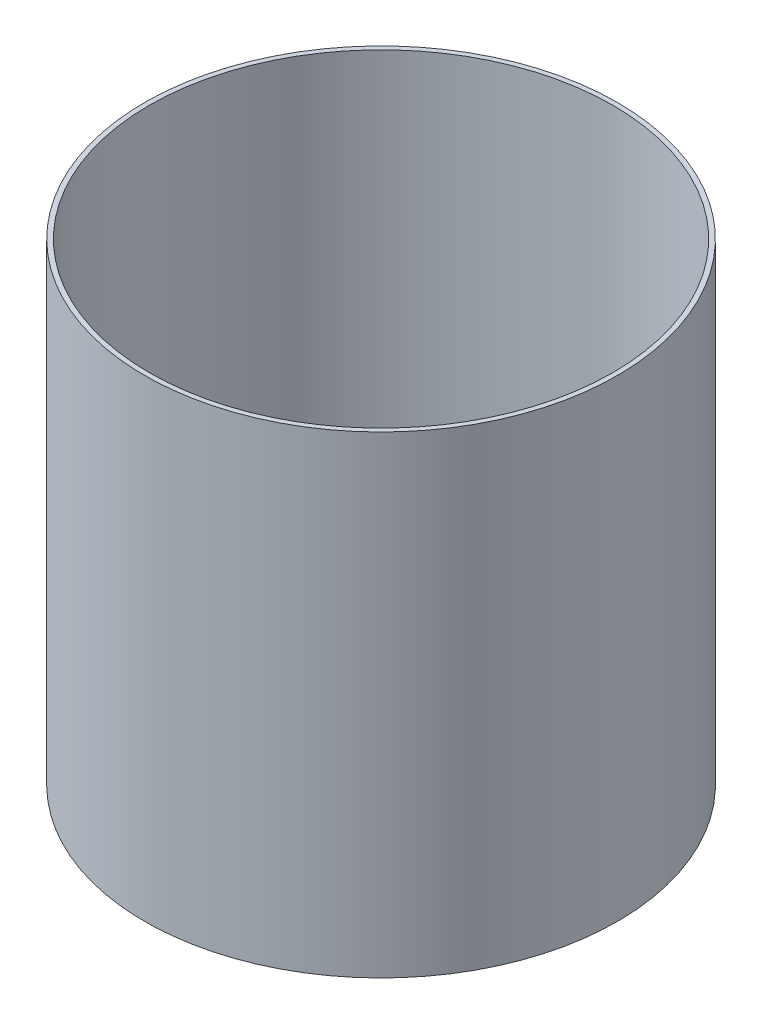
ISO-10303-21;
HEADER;
FILE_DESCRIPTION(('STEP AP214'),'2;1');
FILE_NAME('part.step','',(''),(''),'','','');
FILE_SCHEMA(('AUTOMOTIVE_DESIGN { 1 0 10303 214 1 1 1 1 }'));
ENDSEC;
DATA;
#1=APPLICATION_CONTEXT('core data for automotive mechanical design processes');
#2=APPLICATION_PROTOCOL_DEFINITION('international standard','automotive_design',2000,#1);
#3=PRODUCT_CONTEXT('',#1,'mechanical');
#4=PRODUCT('Part','Part','',(#3));
#5=PRODUCT_RELATED_PRODUCT_CATEGORY('part','',(#4));
#6=PRODUCT_DEFINITION_FORMATION('','',#4);
#7=PRODUCT_DEFINITION_CONTEXT('part definition',#1,'design');
#8=PRODUCT_DEFINITION('design','',#6,#7);
#9=PRODUCT_DEFINITION_SHAPE('','',#8);
#10=(LENGTH_UNIT() NAMED_UNIT(*) SI_UNIT(.MILLI.,.METRE.));
#11=(NAMED_UNIT(*) PLANE_ANGLE_UNIT() SI_UNIT($,.RADIAN.));
#12=(NAMED_UNIT(*) SI_UNIT($,.STERADIAN.) SOLID_ANGLE_UNIT());
#13=UNCERTAINTY_MEASURE_WITH_UNIT(LENGTH_MEASURE(1.E-05),#10,'distance_accuracy_value','');
#14=(GEOMETRIC_REPRESENTATION_CONTEXT(3) GLOBAL_UNCERTAINTY_ASSIGNED_CONTEXT((#13)) GLOBAL_UNIT_ASSIGNED_CONTEXT((#10,
#11,#12)) REPRESENTATION_CONTEXT('',''));
#15=CARTESIAN_POINT('',(0.,0.,0.));
#16=DIRECTION('',(0.,0.,1.));
#17=DIRECTION('',(1.,0.,0.));
#18=AXIS2_PLACEMENT_3D('',#15,#16,#17);
#19=CARTESIAN_POINT('',(0.,0.,0.));
#20=DIRECTION('',(0.,-1.,0.));
#21=DIRECTION('',(0.,0.,-1.));
#22=AXIS2_PLACEMENT_3D('',#19,#20,#21);
#23=CYLINDRICAL_SURFACE('',#22,250.);
#24=CARTESIAN_POINT('',(0.,0.,0.));
#25=DIRECTION('',(0.,-1.,0.));
#26=DIRECTION('',(0.,0.,-1.));
#27=AXIS2_PLACEMENT_3D('',#24,#25,#26);
#28=CIRCLE('',#27,250.);
#29=CARTESIAN_POINT('',(0.,0.,-250.));
#30=VERTEX_POINT('',#29);
#31=EDGE_CURVE('E10',#30,#30,#28,.T.);
#32=ORIENTED_EDGE('',*,*,#31,.F.);
#33=EDGE_LOOP('',(#32));
#34=FACE_BOUND('',#33,.T.);
#35=CARTESIAN_POINT('',(0.,500.,0.));
#36=DIRECTION('',(0.,-1.,0.));
#37=DIRECTION('',(0.,0.,-1.));
#38=AXIS2_PLACEMENT_3D('',#35,#36,#37);
#39=CIRCLE('',#38,250.);
#40=CARTESIAN_POINT('',(0.,500.,-250.));
#41=VERTEX_POINT('',#40);
#42=EDGE_CURVE('E43',#41,#41,#39,.T.);
#43=ORIENTED_EDGE('',*,*,#42,.T.);
#44=EDGE_LOOP('',(#43));
#45=FACE_BOUND('',#44,.T.);
#46=ADVANCED_FACE('F37',(#34,#45),#23,.T.);
#47=CARTESIAN_POINT('',(-250.,0.,0.));
#48=DIRECTION('',(0.,1.,0.));
#49=DIRECTION('',(0.,0.,1.));
#50=AXIS2_PLACEMENT_3D('',#47,#48,#49);
#51=PLANE('',#50);
#52=CARTESIAN_POINT('',(0.,0.,0.));
#53=DIRECTION('',(0.,1.,0.));
#54=DIRECTION('',(0.,0.,1.));
#55=AXIS2_PLACEMENT_3D('',#52,#53,#54);
#56=CIRCLE('',#55,245.);
#57=CARTESIAN_POINT('',(0.,0.,245.));
#58=VERTEX_POINT('',#57);
#59=EDGE_CURVE('E47',#58,#58,#56,.F.);
#60=ORIENTED_EDGE('',*,*,#59,.F.);
#61=EDGE_LOOP('',(#60));
#62=FACE_BOUND('',#61,.T.);
#63=ORIENTED_EDGE('',*,*,#31,.T.);
#64=EDGE_LOOP('',(#63));
#65=FACE_BOUND('',#64,.T.);
#66=ADVANCED_FACE('F67',(#62,#65),#51,.F.);
#67=CARTESIAN_POINT('',(-250.,500.,0.));
#68=DIRECTION('',(0.,-1.,0.));
#69=DIRECTION('',(0.,0.,-1.));
#70=AXIS2_PLACEMENT_3D('',#67,#68,#69);
#71=PLANE('',#70);
#72=CARTESIAN_POINT('',(0.,500.,0.));
#73=DIRECTION('',(0.,-1.,0.));
#74=DIRECTION('',(0.,0.,-1.));
#75=AXIS2_PLACEMENT_3D('',#72,#73,#74);
#76=CIRCLE('',#75,245.);
#77=CARTESIAN_POINT('',(0.,500.,-245.));
#78=VERTEX_POINT('',#77);
#79=EDGE_CURVE('E51',#78,#78,#76,.T.);
#80=ORIENTED_EDGE('',*,*,#79,.T.);
#81=EDGE_LOOP('',(#80));
#82=FACE_BOUND('',#81,.T.);
#83=ORIENTED_EDGE('',*,*,#42,.F.);
#84=EDGE_LOOP('',(#83));
#85=FACE_BOUND('',#84,.T.);
#86=ADVANCED_FACE('F57',(#82,#85),#71,.F.);
#87=CARTESIAN_POINT('',(0.,0.,0.));
#88=DIRECTION('',(0.,-1.,0.));
#89=DIRECTION('',(0.,0.,-1.));
#90=AXIS2_PLACEMENT_3D('',#87,#88,#89);
#91=CYLINDRICAL_SURFACE('',#90,245.);
#92=ORIENTED_EDGE('',*,*,#59,.T.);
#93=EDGE_LOOP('',(#92));
#94=FACE_BOUND('',#93,.T.);
#95=ORIENTED_EDGE('',*,*,#79,.F.);
#96=EDGE_LOOP('',(#95));
#97=FACE_BOUND('',#96,.T.);
#98=ADVANCED_FACE('F60',(#94,#97),#91,.F.);
#99=CLOSED_SHELL('',(#46,#66,#86,#98));
#100=MANIFOLD_SOLID_BREP('B2',#99);
#101=ADVANCED_BREP_SHAPE_REPRESENTATION('',(#18,#100),#14);
#102=SHAPE_DEFINITION_REPRESENTATION(#9,#101);
ENDSEC;
END-ISO-10303-21;
